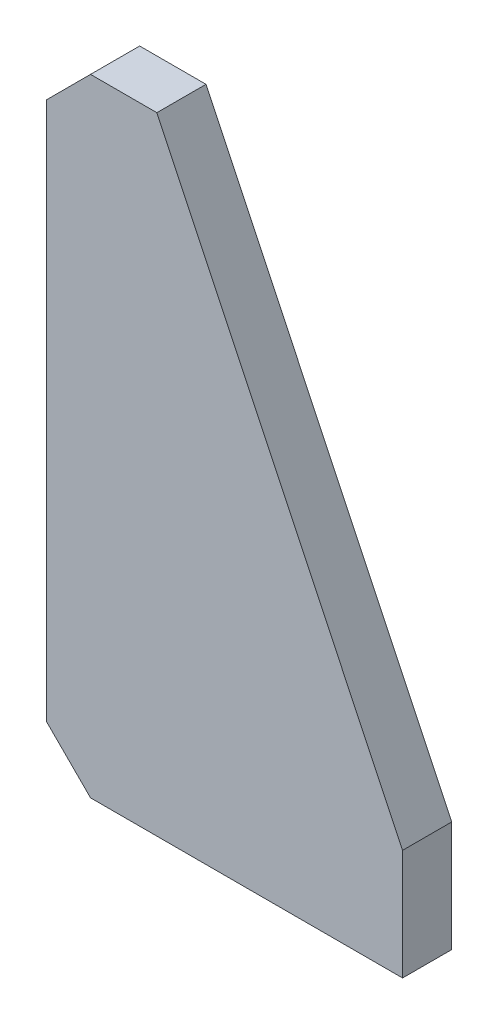
ISO-10303-21;
HEADER;
FILE_DESCRIPTION(('STEP AP214'),'2;1');
FILE_NAME('part.step','',(''),(''),'','','');
FILE_SCHEMA(('AUTOMOTIVE_DESIGN { 1 0 10303 214 1 1 1 1 }'));
ENDSEC;
DATA;
#1=APPLICATION_CONTEXT('core data for automotive mechanical design processes');
#2=APPLICATION_PROTOCOL_DEFINITION('international standard','automotive_design',2000,#1);
#3=PRODUCT_CONTEXT('',#1,'mechanical');
#4=PRODUCT('Part','Part','',(#3));
#5=PRODUCT_RELATED_PRODUCT_CATEGORY('part','',(#4));
#6=PRODUCT_DEFINITION_FORMATION('','',#4);
#7=PRODUCT_DEFINITION_CONTEXT('part definition',#1,'design');
#8=PRODUCT_DEFINITION('design','',#6,#7);
#9=PRODUCT_DEFINITION_SHAPE('','',#8);
#10=(LENGTH_UNIT() NAMED_UNIT(*) SI_UNIT(.MILLI.,.METRE.));
#11=(NAMED_UNIT(*) PLANE_ANGLE_UNIT() SI_UNIT($,.RADIAN.));
#12=(NAMED_UNIT(*) SI_UNIT($,.STERADIAN.) SOLID_ANGLE_UNIT());
#13=UNCERTAINTY_MEASURE_WITH_UNIT(LENGTH_MEASURE(1.E-05),#10,'distance_accuracy_value','');
#14=(GEOMETRIC_REPRESENTATION_CONTEXT(3) GLOBAL_UNCERTAINTY_ASSIGNED_CONTEXT((#13)) GLOBAL_UNIT_ASSIGNED_CONTEXT((#10,
#11,#12)) REPRESENTATION_CONTEXT('',''));
#15=CARTESIAN_POINT('',(0.,0.,0.));
#16=DIRECTION('',(0.,0.,1.));
#17=DIRECTION('',(1.,0.,0.));
#18=AXIS2_PLACEMENT_3D('',#15,#16,#17);
#19=CARTESIAN_POINT('',(-127.,255.,20.));
#20=DIRECTION('',(0.707106781186549,-0.707106781186546,0.));
#21=DIRECTION('',(0.707106781186546,0.707106781186549,0.));
#22=AXIS2_PLACEMENT_3D('',#19,#20,#21);
#23=PLANE('',#22);
#24=DIRECTION('',(-0.707106781186546,-0.707106781186549,0.));
#25=VECTOR('',#24,1.);
#26=CARTESIAN_POINT('',(-127.,255.,0.));
#27=LINE('',#26,#25);
#28=CARTESIAN_POINT('',(-127.,255.,0.));
#29=VERTEX_POINT('',#28);
#30=CARTESIAN_POINT('',(-145.,237.,0.));
#31=VERTEX_POINT('',#30);
#32=EDGE_CURVE('E114',#29,#31,#27,.T.);
#33=ORIENTED_EDGE('',*,*,#32,.T.);
#34=DIRECTION('',(0.,0.,-1.));
#35=VECTOR('',#34,1.);
#36=CARTESIAN_POINT('',(-145.,237.,20.));
#37=LINE('',#36,#35);
#38=CARTESIAN_POINT('',(-145.,237.,20.));
#39=VERTEX_POINT('',#38);
#40=EDGE_CURVE('E97',#39,#31,#37,.T.);
#41=ORIENTED_EDGE('',*,*,#40,.F.);
#42=DIRECTION('',(-0.707106781186546,-0.707106781186549,0.));
#43=VECTOR('',#42,1.);
#44=CARTESIAN_POINT('',(-127.,255.,20.));
#45=LINE('',#44,#43);
#46=CARTESIAN_POINT('',(-127.,255.,20.));
#47=VERTEX_POINT('',#46);
#48=EDGE_CURVE('E102',#47,#39,#45,.T.);
#49=ORIENTED_EDGE('',*,*,#48,.F.);
#50=DIRECTION('',(0.,0.,-1.));
#51=VECTOR('',#50,1.);
#52=CARTESIAN_POINT('',(-127.,255.,20.));
#53=LINE('',#52,#51);
#54=EDGE_CURVE('E130',#47,#29,#53,.T.);
#55=ORIENTED_EDGE('',*,*,#54,.T.);
#56=EDGE_LOOP('',(#33,#41,#49,#55));
#57=FACE_BOUND('',#56,.T.);
#58=ADVANCED_FACE('F37',(#57),#23,.F.);
#59=CARTESIAN_POINT('',(-145.,237.,20.));
#60=DIRECTION('',(1.,0.,0.));
#61=DIRECTION('',(0.,0.,-1.));
#62=AXIS2_PLACEMENT_3D('',#59,#60,#61);
#63=PLANE('',#62);
#64=DIRECTION('',(0.,-1.,0.));
#65=VECTOR('',#64,1.);
#66=CARTESIAN_POINT('',(-145.,237.,0.));
#67=LINE('',#66,#65);
#68=CARTESIAN_POINT('',(-145.,18.0000000000001,0.));
#69=VERTEX_POINT('',#68);
#70=EDGE_CURVE('E139',#31,#69,#67,.T.);
#71=ORIENTED_EDGE('',*,*,#70,.T.);
#72=DIRECTION('',(0.,0.,1.));
#73=VECTOR('',#72,1.);
#74=CARTESIAN_POINT('',(-145.,18.0000000000001,20.));
#75=LINE('',#74,#73);
#76=CARTESIAN_POINT('',(-145.,18.0000000000001,20.));
#77=VERTEX_POINT('',#76);
#78=EDGE_CURVE('E46',#69,#77,#75,.T.);
#79=ORIENTED_EDGE('',*,*,#78,.T.);
#80=DIRECTION('',(0.,-1.,0.));
#81=VECTOR('',#80,1.);
#82=CARTESIAN_POINT('',(-145.,237.,20.));
#83=LINE('',#82,#81);
#84=EDGE_CURVE('E93',#39,#77,#83,.T.);
#85=ORIENTED_EDGE('',*,*,#84,.F.);
#86=ORIENTED_EDGE('',*,*,#40,.T.);
#87=EDGE_LOOP('',(#71,#79,#85,#86));
#88=FACE_BOUND('',#87,.T.);
#89=ADVANCED_FACE('F95',(#88),#63,.F.);
#90=CARTESIAN_POINT('',(-145.,0.,20.));
#91=DIRECTION('',(0.,1.,0.));
#92=DIRECTION('',(-1.,0.,0.));
#93=AXIS2_PLACEMENT_3D('',#90,#91,#92);
#94=PLANE('',#93);
#95=DIRECTION('',(1.,0.,0.));
#96=VECTOR('',#95,1.);
#97=CARTESIAN_POINT('',(-145.,0.,20.));
#98=LINE('',#97,#96);
#99=CARTESIAN_POINT('',(-127.,0.,20.));
#100=VERTEX_POINT('',#99);
#101=CARTESIAN_POINT('',(0.,0.,20.));
#102=VERTEX_POINT('',#101);
#103=EDGE_CURVE('E101',#100,#102,#98,.T.);
#104=ORIENTED_EDGE('',*,*,#103,.F.);
#105=DIRECTION('',(0.,0.,-1.));
#106=VECTOR('',#105,1.);
#107=CARTESIAN_POINT('',(-127.,0.,20.));
#108=LINE('',#107,#106);
#109=CARTESIAN_POINT('',(-127.,0.,0.));
#110=VERTEX_POINT('',#109);
#111=EDGE_CURVE('E115',#100,#110,#108,.T.);
#112=ORIENTED_EDGE('',*,*,#111,.T.);
#113=DIRECTION('',(1.,0.,0.));
#114=VECTOR('',#113,1.);
#115=CARTESIAN_POINT('',(-145.,0.,0.));
#116=LINE('',#115,#114);
#117=CARTESIAN_POINT('',(0.,0.,0.));
#118=VERTEX_POINT('',#117);
#119=EDGE_CURVE('E137',#110,#118,#116,.T.);
#120=ORIENTED_EDGE('',*,*,#119,.T.);
#121=DIRECTION('',(0.,0.,-1.));
#122=VECTOR('',#121,1.);
#123=CARTESIAN_POINT('',(0.,0.,20.));
#124=LINE('',#123,#122);
#125=EDGE_CURVE('E116',#102,#118,#124,.T.);
#126=ORIENTED_EDGE('',*,*,#125,.F.);
#127=EDGE_LOOP('',(#104,#112,#120,#126));
#128=FACE_BOUND('',#127,.T.);
#129=ADVANCED_FACE('F153',(#128),#94,.F.);
#130=CARTESIAN_POINT('',(0.,0.,20.));
#131=DIRECTION('',(-1.,0.,0.));
#132=DIRECTION('',(0.,0.,1.));
#133=AXIS2_PLACEMENT_3D('',#130,#131,#132);
#134=PLANE('',#133);
#135=DIRECTION('',(0.,1.,0.));
#136=VECTOR('',#135,1.);
#137=CARTESIAN_POINT('',(0.,0.,0.));
#138=LINE('',#137,#136);
#139=CARTESIAN_POINT('',(0.,45.,0.));
#140=VERTEX_POINT('',#139);
#141=EDGE_CURVE('E135',#118,#140,#138,.T.);
#142=ORIENTED_EDGE('',*,*,#141,.T.);
#143=DIRECTION('',(0.,0.,-1.));
#144=VECTOR('',#143,1.);
#145=CARTESIAN_POINT('',(0.,45.,20.));
#146=LINE('',#145,#144);
#147=CARTESIAN_POINT('',(0.,45.,20.));
#148=VERTEX_POINT('',#147);
#149=EDGE_CURVE('E121',#148,#140,#146,.T.);
#150=ORIENTED_EDGE('',*,*,#149,.F.);
#151=DIRECTION('',(0.,1.,0.));
#152=VECTOR('',#151,1.);
#153=CARTESIAN_POINT('',(0.,0.,20.));
#154=LINE('',#153,#152);
#155=EDGE_CURVE('E145',#102,#148,#154,.T.);
#156=ORIENTED_EDGE('',*,*,#155,.F.);
#157=ORIENTED_EDGE('',*,*,#125,.T.);
#158=EDGE_LOOP('',(#142,#150,#156,#157));
#159=FACE_BOUND('',#158,.T.);
#160=ADVANCED_FACE('F156',(#159),#134,.F.);
#161=CARTESIAN_POINT('',(0.,45.,20.));
#162=DIRECTION('',(-0.90286051882393,-0.429933580392348,0.));
#163=DIRECTION('',(0.429933580392348,-0.90286051882393,0.));
#164=AXIS2_PLACEMENT_3D('',#161,#162,#163);
#165=PLANE('',#164);
#166=DIRECTION('',(-0.429933580392348,0.90286051882393,0.));
#167=VECTOR('',#166,1.);
#168=CARTESIAN_POINT('',(0.,45.,0.));
#169=LINE('',#168,#167);
#170=CARTESIAN_POINT('',(-100.,255.,0.));
#171=VERTEX_POINT('',#170);
#172=EDGE_CURVE('E133',#140,#171,#169,.T.);
#173=ORIENTED_EDGE('',*,*,#172,.T.);
#174=DIRECTION('',(0.,0.,-1.));
#175=VECTOR('',#174,1.);
#176=CARTESIAN_POINT('',(-100.,255.,20.));
#177=LINE('',#176,#175);
#178=CARTESIAN_POINT('',(-100.,255.,20.));
#179=VERTEX_POINT('',#178);
#180=EDGE_CURVE('E127',#179,#171,#177,.T.);
#181=ORIENTED_EDGE('',*,*,#180,.F.);
#182=DIRECTION('',(-0.429933580392348,0.90286051882393,0.));
#183=VECTOR('',#182,1.);
#184=CARTESIAN_POINT('',(0.,45.,20.));
#185=LINE('',#184,#183);
#186=EDGE_CURVE('E143',#148,#179,#185,.T.);
#187=ORIENTED_EDGE('',*,*,#186,.F.);
#188=ORIENTED_EDGE('',*,*,#149,.T.);
#189=EDGE_LOOP('',(#173,#181,#187,#188));
#190=FACE_BOUND('',#189,.T.);
#191=ADVANCED_FACE('F161',(#190),#165,.F.);
#192=CARTESIAN_POINT('',(-100.,255.,20.));
#193=DIRECTION('',(0.,-1.,0.));
#194=DIRECTION('',(0.,0.,-1.));
#195=AXIS2_PLACEMENT_3D('',#192,#193,#194);
#196=PLANE('',#195);
#197=DIRECTION('',(-1.,0.,0.));
#198=VECTOR('',#197,1.);
#199=CARTESIAN_POINT('',(-100.,255.,0.));
#200=LINE('',#199,#198);
#201=EDGE_CURVE('E111',#171,#29,#200,.T.);
#202=ORIENTED_EDGE('',*,*,#201,.T.);
#203=ORIENTED_EDGE('',*,*,#54,.F.);
#204=DIRECTION('',(-1.,0.,0.));
#205=VECTOR('',#204,1.);
#206=CARTESIAN_POINT('',(-100.,255.,20.));
#207=LINE('',#206,#205);
#208=EDGE_CURVE('E107',#179,#47,#207,.T.);
#209=ORIENTED_EDGE('',*,*,#208,.F.);
#210=ORIENTED_EDGE('',*,*,#180,.T.);
#211=EDGE_LOOP('',(#202,#203,#209,#210));
#212=FACE_BOUND('',#211,.T.);
#213=ADVANCED_FACE('F164',(#212),#196,.F.);
#214=CARTESIAN_POINT('',(0.,0.,20.));
#215=DIRECTION('',(0.,0.,-1.));
#216=DIRECTION('',(-1.,0.,0.));
#217=AXIS2_PLACEMENT_3D('',#214,#215,#216);
#218=PLANE('',#217);
#219=ORIENTED_EDGE('',*,*,#84,.T.);
#220=DIRECTION('',(-0.707106781186546,0.707106781186549,0.));
#221=VECTOR('',#220,1.);
#222=CARTESIAN_POINT('',(-127.,0.,20.));
#223=LINE('',#222,#221);
#224=EDGE_CURVE('E11',#77,#100,#223,.F.);
#225=ORIENTED_EDGE('',*,*,#224,.T.);
#226=ORIENTED_EDGE('',*,*,#103,.T.);
#227=ORIENTED_EDGE('',*,*,#155,.T.);
#228=ORIENTED_EDGE('',*,*,#186,.T.);
#229=ORIENTED_EDGE('',*,*,#208,.T.);
#230=ORIENTED_EDGE('',*,*,#48,.T.);
#231=EDGE_LOOP('',(#219,#225,#226,#227,#228,#229,#230));
#232=FACE_BOUND('',#231,.T.);
#233=ADVANCED_FACE('F105',(#232),#218,.F.);
#234=CARTESIAN_POINT('',(0.,0.,0.));
#235=DIRECTION('',(0.,0.,-1.));
#236=DIRECTION('',(-1.,0.,0.));
#237=AXIS2_PLACEMENT_3D('',#234,#235,#236);
#238=PLANE('',#237);
#239=ORIENTED_EDGE('',*,*,#119,.F.);
#240=DIRECTION('',(0.707106781186546,-0.707106781186549,0.));
#241=VECTOR('',#240,1.);
#242=CARTESIAN_POINT('',(-63.5000000000002,-63.5,0.));
#243=LINE('',#242,#241);
#244=EDGE_CURVE('E60',#110,#69,#243,.F.);
#245=ORIENTED_EDGE('',*,*,#244,.T.);
#246=ORIENTED_EDGE('',*,*,#70,.F.);
#247=ORIENTED_EDGE('',*,*,#32,.F.);
#248=ORIENTED_EDGE('',*,*,#201,.F.);
#249=ORIENTED_EDGE('',*,*,#172,.F.);
#250=ORIENTED_EDGE('',*,*,#141,.F.);
#251=EDGE_LOOP('',(#239,#245,#246,#247,#248,#249,#250));
#252=FACE_BOUND('',#251,.T.);
#253=ADVANCED_FACE('F165',(#252),#238,.T.);
#254=CARTESIAN_POINT('',(-127.,0.,20.));
#255=DIRECTION('',(0.707106781186549,0.707106781186546,0.));
#256=DIRECTION('',(0.,0.,-1.));
#257=AXIS2_PLACEMENT_3D('',#254,#255,#256);
#258=PLANE('',#257);
#259=ORIENTED_EDGE('',*,*,#224,.F.);
#260=ORIENTED_EDGE('',*,*,#78,.F.);
#261=ORIENTED_EDGE('',*,*,#244,.F.);
#262=ORIENTED_EDGE('',*,*,#111,.F.);
#263=EDGE_LOOP('',(#259,#260,#261,#262));
#264=FACE_BOUND('',#263,.T.);
#265=ADVANCED_FACE('F40',(#264),#258,.F.);
#266=CLOSED_SHELL('',(#58,#89,#129,#160,#191,#213,#233,#253,#265));
#267=MANIFOLD_SOLID_BREP('B2',#266);
#268=ADVANCED_BREP_SHAPE_REPRESENTATION('',(#18,#267),#14);
#269=SHAPE_DEFINITION_REPRESENTATION(#9,#268);
ENDSEC;
END-ISO-10303-21;
